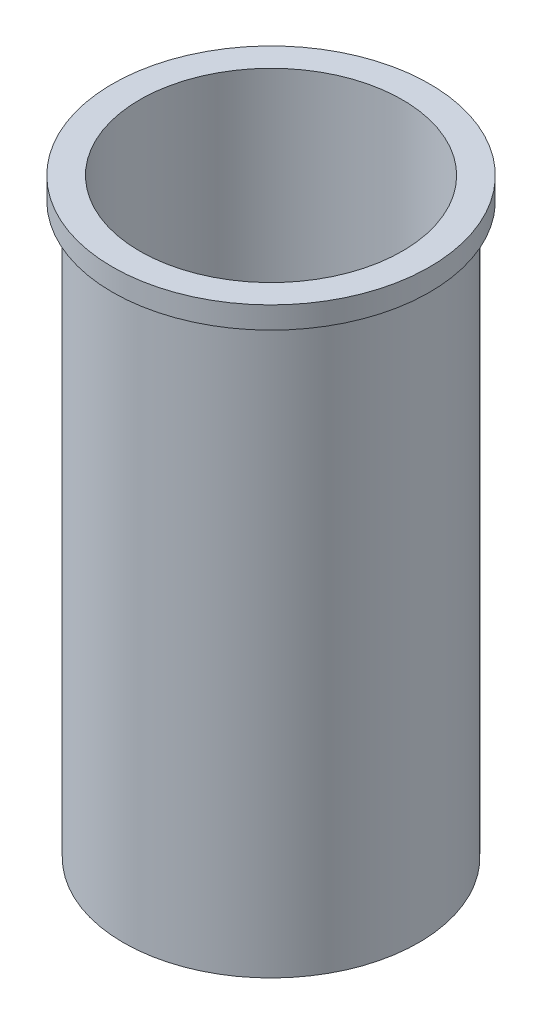
ISO-10303-21;
HEADER;
FILE_DESCRIPTION(('STEP AP214'),'2;1');
FILE_NAME('part.step','',(''),(''),'','','');
FILE_SCHEMA(('AUTOMOTIVE_DESIGN { 1 0 10303 214 1 1 1 1 }'));
ENDSEC;
DATA;
#1=APPLICATION_CONTEXT('core data for automotive mechanical design processes');
#2=APPLICATION_PROTOCOL_DEFINITION('international standard','automotive_design',2000,#1);
#3=PRODUCT_CONTEXT('',#1,'mechanical');
#4=PRODUCT('Part','Part','',(#3));
#5=PRODUCT_RELATED_PRODUCT_CATEGORY('part','',(#4));
#6=PRODUCT_DEFINITION_FORMATION('','',#4);
#7=PRODUCT_DEFINITION_CONTEXT('part definition',#1,'design');
#8=PRODUCT_DEFINITION('design','',#6,#7);
#9=PRODUCT_DEFINITION_SHAPE('','',#8);
#10=(LENGTH_UNIT() NAMED_UNIT(*) SI_UNIT(.MILLI.,.METRE.));
#11=(NAMED_UNIT(*) PLANE_ANGLE_UNIT() SI_UNIT($,.RADIAN.));
#12=(NAMED_UNIT(*) SI_UNIT($,.STERADIAN.) SOLID_ANGLE_UNIT());
#13=UNCERTAINTY_MEASURE_WITH_UNIT(LENGTH_MEASURE(1.E-05),#10,'distance_accuracy_value','');
#14=(GEOMETRIC_REPRESENTATION_CONTEXT(3) GLOBAL_UNCERTAINTY_ASSIGNED_CONTEXT((#13)) GLOBAL_UNIT_ASSIGNED_CONTEXT((#10,
#11,#12)) REPRESENTATION_CONTEXT('',''));
#15=CARTESIAN_POINT('',(0.,0.,0.));
#16=DIRECTION('',(0.,0.,1.));
#17=DIRECTION('',(1.,0.,0.));
#18=AXIS2_PLACEMENT_3D('',#15,#16,#17);
#19=CARTESIAN_POINT('',(0.,27.,0.));
#20=DIRECTION('',(0.,-1.,0.));
#21=DIRECTION('',(0.,0.,-1.));
#22=AXIS2_PLACEMENT_3D('',#19,#20,#21);
#23=CYLINDRICAL_SURFACE('',#22,6.75);
#24=CARTESIAN_POINT('',(0.,0.,0.));
#25=DIRECTION('',(0.,1.,0.));
#26=DIRECTION('',(0.,0.,1.));
#27=AXIS2_PLACEMENT_3D('',#24,#25,#26);
#28=CIRCLE('',#27,6.75);
#29=CARTESIAN_POINT('',(0.,0.,6.75));
#30=VERTEX_POINT('',#29);
#31=EDGE_CURVE('E46',#30,#30,#28,.T.);
#32=ORIENTED_EDGE('',*,*,#31,.T.);
#33=EDGE_LOOP('',(#32));
#34=FACE_BOUND('',#33,.T.);
#35=CARTESIAN_POINT('',(0.,26.,0.));
#36=DIRECTION('',(0.,1.,0.));
#37=DIRECTION('',(0.,0.,1.));
#38=AXIS2_PLACEMENT_3D('',#35,#36,#37);
#39=CIRCLE('',#38,6.75);
#40=CARTESIAN_POINT('',(0.,26.,6.75));
#41=VERTEX_POINT('',#40);
#42=EDGE_CURVE('E10',#41,#41,#39,.T.);
#43=ORIENTED_EDGE('',*,*,#42,.F.);
#44=EDGE_LOOP('',(#43));
#45=FACE_BOUND('',#44,.T.);
#46=ADVANCED_FACE('F39',(#34,#45),#23,.T.);
#47=CARTESIAN_POINT('',(0.,27.,0.));
#48=DIRECTION('',(0.,1.,0.));
#49=DIRECTION('',(0.,0.,1.));
#50=AXIS2_PLACEMENT_3D('',#47,#48,#49);
#51=PLANE('',#50);
#52=CARTESIAN_POINT('',(0.,27.,0.));
#53=DIRECTION('',(0.,1.,0.));
#54=DIRECTION('',(0.,0.,1.));
#55=AXIS2_PLACEMENT_3D('',#52,#53,#54);
#56=CIRCLE('',#55,6.);
#57=CARTESIAN_POINT('',(0.,27.,6.));
#58=VERTEX_POINT('',#57);
#59=EDGE_CURVE('E51',#58,#58,#56,.T.);
#60=ORIENTED_EDGE('',*,*,#59,.F.);
#61=EDGE_LOOP('',(#60));
#62=FACE_BOUND('',#61,.T.);
#63=CARTESIAN_POINT('',(0.,27.,0.));
#64=DIRECTION('',(0.,1.,0.));
#65=DIRECTION('',(0.,0.,1.));
#66=AXIS2_PLACEMENT_3D('',#63,#64,#65);
#67=CIRCLE('',#66,7.25);
#68=CARTESIAN_POINT('',(0.,27.,7.25));
#69=VERTEX_POINT('',#68);
#70=EDGE_CURVE('E63',#69,#69,#67,.T.);
#71=ORIENTED_EDGE('',*,*,#70,.T.);
#72=EDGE_LOOP('',(#71));
#73=FACE_BOUND('',#72,.T.);
#74=ADVANCED_FACE('F83',(#62,#73),#51,.T.);
#75=CARTESIAN_POINT('',(0.,0.,0.));
#76=DIRECTION('',(0.,1.,0.));
#77=DIRECTION('',(0.,0.,1.));
#78=AXIS2_PLACEMENT_3D('',#75,#76,#77);
#79=PLANE('',#78);
#80=ORIENTED_EDGE('',*,*,#31,.F.);
#81=EDGE_LOOP('',(#80));
#82=FACE_BOUND('',#81,.T.);
#83=CARTESIAN_POINT('',(0.,0.,0.));
#84=DIRECTION('',(0.,1.,0.));
#85=DIRECTION('',(0.,0.,1.));
#86=AXIS2_PLACEMENT_3D('',#83,#84,#85);
#87=CIRCLE('',#86,6.);
#88=CARTESIAN_POINT('',(0.,0.,6.));
#89=VERTEX_POINT('',#88);
#90=EDGE_CURVE('E56',#89,#89,#87,.T.);
#91=ORIENTED_EDGE('',*,*,#90,.T.);
#92=EDGE_LOOP('',(#91));
#93=FACE_BOUND('',#92,.T.);
#94=ADVANCED_FACE('F87',(#82,#93),#79,.F.);
#95=CARTESIAN_POINT('',(0.,27.,0.));
#96=DIRECTION('',(0.,-1.,0.));
#97=DIRECTION('',(0.,0.,-1.));
#98=AXIS2_PLACEMENT_3D('',#95,#96,#97);
#99=CYLINDRICAL_SURFACE('',#98,6.);
#100=ORIENTED_EDGE('',*,*,#59,.T.);
#101=EDGE_LOOP('',(#100));
#102=FACE_BOUND('',#101,.T.);
#103=ORIENTED_EDGE('',*,*,#90,.F.);
#104=EDGE_LOOP('',(#103));
#105=FACE_BOUND('',#104,.T.);
#106=ADVANCED_FACE('F80',(#102,#105),#99,.F.);
#107=CARTESIAN_POINT('',(0.,26.,0.));
#108=DIRECTION('',(0.,1.,0.));
#109=DIRECTION('',(0.,0.,1.));
#110=AXIS2_PLACEMENT_3D('',#107,#108,#109);
#111=CYLINDRICAL_SURFACE('',#110,7.25);
#112=CARTESIAN_POINT('',(0.,26.,0.));
#113=DIRECTION('',(0.,1.,0.));
#114=DIRECTION('',(0.,0.,1.));
#115=AXIS2_PLACEMENT_3D('',#112,#113,#114);
#116=CIRCLE('',#115,7.25);
#117=CARTESIAN_POINT('',(0.,26.,7.25));
#118=VERTEX_POINT('',#117);
#119=EDGE_CURVE('E61',#118,#118,#116,.T.);
#120=ORIENTED_EDGE('',*,*,#119,.T.);
#121=EDGE_LOOP('',(#120));
#122=FACE_BOUND('',#121,.T.);
#123=ORIENTED_EDGE('',*,*,#70,.F.);
#124=EDGE_LOOP('',(#123));
#125=FACE_BOUND('',#124,.T.);
#126=ADVANCED_FACE('F71',(#122,#125),#111,.T.);
#127=CARTESIAN_POINT('',(0.,26.,0.));
#128=DIRECTION('',(0.,1.,0.));
#129=DIRECTION('',(0.,0.,1.));
#130=AXIS2_PLACEMENT_3D('',#127,#128,#129);
#131=PLANE('',#130);
#132=ORIENTED_EDGE('',*,*,#42,.T.);
#133=EDGE_LOOP('',(#132));
#134=FACE_BOUND('',#133,.T.);
#135=ORIENTED_EDGE('',*,*,#119,.F.);
#136=EDGE_LOOP('',(#135));
#137=FACE_BOUND('',#136,.T.);
#138=ADVANCED_FACE('F74',(#134,#137),#131,.F.);
#139=CLOSED_SHELL('',(#46,#74,#94,#106,#126,#138));
#140=MANIFOLD_SOLID_BREP('B2',#139);
#141=ADVANCED_BREP_SHAPE_REPRESENTATION('',(#18,#140),#14);
#142=SHAPE_DEFINITION_REPRESENTATION(#9,#141);
ENDSEC;
END-ISO-10303-21;
